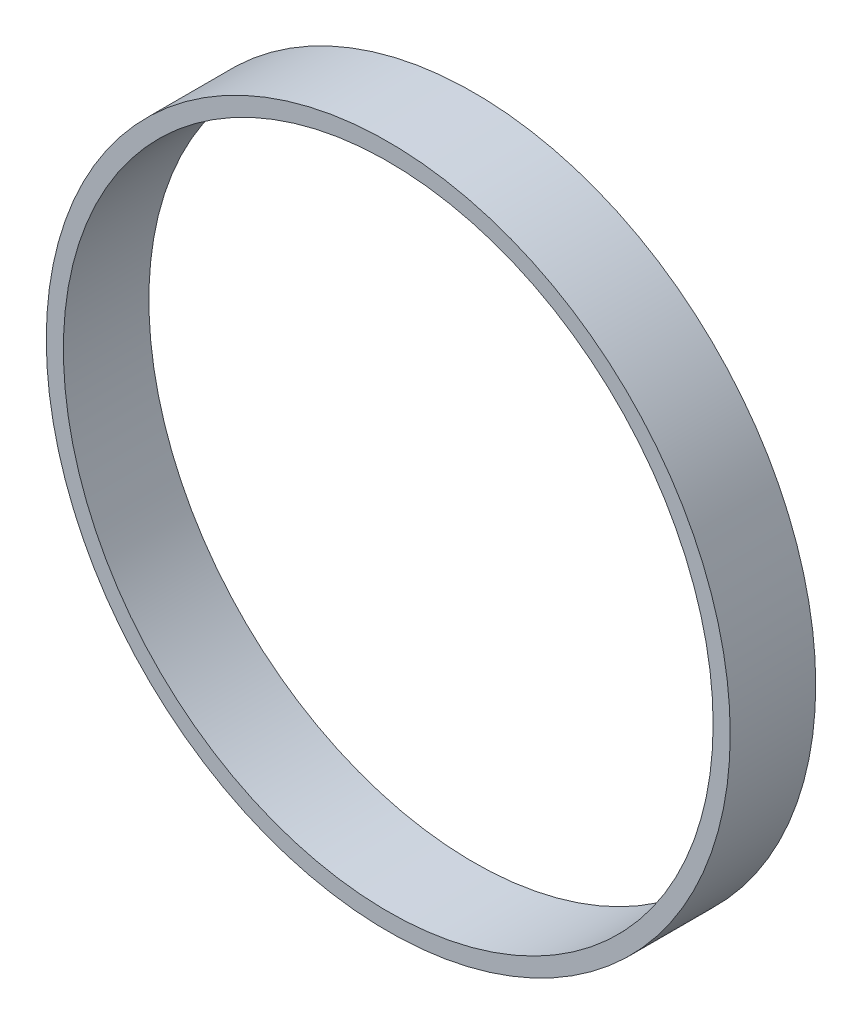
ISO-10303-21;
HEADER;
FILE_DESCRIPTION(('STEP AP214'),'2;1');
FILE_NAME('part.step','',(''),(''),'','','');
FILE_SCHEMA(('AUTOMOTIVE_DESIGN { 1 0 10303 214 1 1 1 1 }'));
ENDSEC;
DATA;
#1=APPLICATION_CONTEXT('core data for automotive mechanical design processes');
#2=APPLICATION_PROTOCOL_DEFINITION('international standard','automotive_design',2000,#1);
#3=PRODUCT_CONTEXT('',#1,'mechanical');
#4=PRODUCT('Part','Part','',(#3));
#5=PRODUCT_RELATED_PRODUCT_CATEGORY('part','',(#4));
#6=PRODUCT_DEFINITION_FORMATION('','',#4);
#7=PRODUCT_DEFINITION_CONTEXT('part definition',#1,'design');
#8=PRODUCT_DEFINITION('design','',#6,#7);
#9=PRODUCT_DEFINITION_SHAPE('','',#8);
#10=(LENGTH_UNIT() NAMED_UNIT(*) SI_UNIT(.MILLI.,.METRE.));
#11=(NAMED_UNIT(*) PLANE_ANGLE_UNIT() SI_UNIT($,.RADIAN.));
#12=(NAMED_UNIT(*) SI_UNIT($,.STERADIAN.) SOLID_ANGLE_UNIT());
#13=UNCERTAINTY_MEASURE_WITH_UNIT(LENGTH_MEASURE(1.E-05),#10,'distance_accuracy_value','');
#14=(GEOMETRIC_REPRESENTATION_CONTEXT(3) GLOBAL_UNCERTAINTY_ASSIGNED_CONTEXT((#13)) GLOBAL_UNIT_ASSIGNED_CONTEXT((#10,
#11,#12)) REPRESENTATION_CONTEXT('',''));
#15=CARTESIAN_POINT('',(0.,0.,0.));
#16=DIRECTION('',(0.,0.,1.));
#17=DIRECTION('',(1.,0.,0.));
#18=AXIS2_PLACEMENT_3D('',#15,#16,#17);
#19=CARTESIAN_POINT('',(0.,0.,10.));
#20=DIRECTION('',(0.,0.,1.));
#21=DIRECTION('',(1.,0.,0.));
#22=AXIS2_PLACEMENT_3D('',#19,#20,#21);
#23=PLANE('',#22);
#24=CARTESIAN_POINT('',(0.,0.,10.));
#25=DIRECTION('',(0.,0.,1.));
#26=DIRECTION('',(1.,0.,0.));
#27=AXIS2_PLACEMENT_3D('',#24,#25,#26);
#28=CIRCLE('',#27,40.);
#29=CARTESIAN_POINT('',(40.,0.,10.));
#30=VERTEX_POINT('',#29);
#31=EDGE_CURVE('E10',#30,#30,#28,.T.);
#32=ORIENTED_EDGE('',*,*,#31,.T.);
#33=EDGE_LOOP('',(#32));
#34=FACE_BOUND('',#33,.T.);
#35=CARTESIAN_POINT('',(0.,0.,10.));
#36=DIRECTION('',(0.,0.,1.));
#37=DIRECTION('',(1.,0.,0.));
#38=AXIS2_PLACEMENT_3D('',#35,#36,#37);
#39=CIRCLE('',#38,38.);
#40=CARTESIAN_POINT('',(38.,0.,10.));
#41=VERTEX_POINT('',#40);
#42=EDGE_CURVE('E41',#41,#41,#39,.T.);
#43=ORIENTED_EDGE('',*,*,#42,.F.);
#44=EDGE_LOOP('',(#43));
#45=FACE_BOUND('',#44,.T.);
#46=ADVANCED_FACE('F30',(#34,#45),#23,.T.);
#47=CARTESIAN_POINT('',(0.,0.,0.));
#48=DIRECTION('',(0.,0.,1.));
#49=DIRECTION('',(1.,0.,0.));
#50=AXIS2_PLACEMENT_3D('',#47,#48,#49);
#51=PLANE('',#50);
#52=CARTESIAN_POINT('',(0.,0.,0.));
#53=DIRECTION('',(0.,0.,1.));
#54=DIRECTION('',(1.,0.,0.));
#55=AXIS2_PLACEMENT_3D('',#52,#53,#54);
#56=CIRCLE('',#55,40.);
#57=CARTESIAN_POINT('',(40.,0.,0.));
#58=VERTEX_POINT('',#57);
#59=EDGE_CURVE('E34',#58,#58,#56,.T.);
#60=ORIENTED_EDGE('',*,*,#59,.F.);
#61=EDGE_LOOP('',(#60));
#62=FACE_BOUND('',#61,.T.);
#63=CARTESIAN_POINT('',(0.,0.,0.));
#64=DIRECTION('',(0.,0.,1.));
#65=DIRECTION('',(1.,0.,0.));
#66=AXIS2_PLACEMENT_3D('',#63,#64,#65);
#67=CIRCLE('',#66,38.);
#68=CARTESIAN_POINT('',(38.,0.,0.));
#69=VERTEX_POINT('',#68);
#70=EDGE_CURVE('E43',#69,#69,#67,.T.);
#71=ORIENTED_EDGE('',*,*,#70,.T.);
#72=EDGE_LOOP('',(#71));
#73=FACE_BOUND('',#72,.T.);
#74=ADVANCED_FACE('F53',(#62,#73),#51,.F.);
#75=CARTESIAN_POINT('',(0.,0.,10.));
#76=DIRECTION('',(0.,0.,-1.));
#77=DIRECTION('',(-1.,0.,0.));
#78=AXIS2_PLACEMENT_3D('',#75,#76,#77);
#79=CYLINDRICAL_SURFACE('',#78,40.);
#80=ORIENTED_EDGE('',*,*,#31,.F.);
#81=EDGE_LOOP('',(#80));
#82=FACE_BOUND('',#81,.T.);
#83=ORIENTED_EDGE('',*,*,#59,.T.);
#84=EDGE_LOOP('',(#83));
#85=FACE_BOUND('',#84,.T.);
#86=ADVANCED_FACE('F32',(#82,#85),#79,.T.);
#87=CARTESIAN_POINT('',(0.,0.,10.));
#88=DIRECTION('',(0.,0.,-1.));
#89=DIRECTION('',(-1.,0.,0.));
#90=AXIS2_PLACEMENT_3D('',#87,#88,#89);
#91=CYLINDRICAL_SURFACE('',#90,38.);
#92=ORIENTED_EDGE('',*,*,#42,.T.);
#93=EDGE_LOOP('',(#92));
#94=FACE_BOUND('',#93,.T.);
#95=ORIENTED_EDGE('',*,*,#70,.F.);
#96=EDGE_LOOP('',(#95));
#97=FACE_BOUND('',#96,.T.);
#98=ADVANCED_FACE('F49',(#94,#97),#91,.F.);
#99=CLOSED_SHELL('',(#46,#74,#86,#98));
#100=MANIFOLD_SOLID_BREP('B2',#99);
#101=ADVANCED_BREP_SHAPE_REPRESENTATION('',(#18,#100),#14);
#102=SHAPE_DEFINITION_REPRESENTATION(#9,#101);
ENDSEC;
END-ISO-10303-21;
